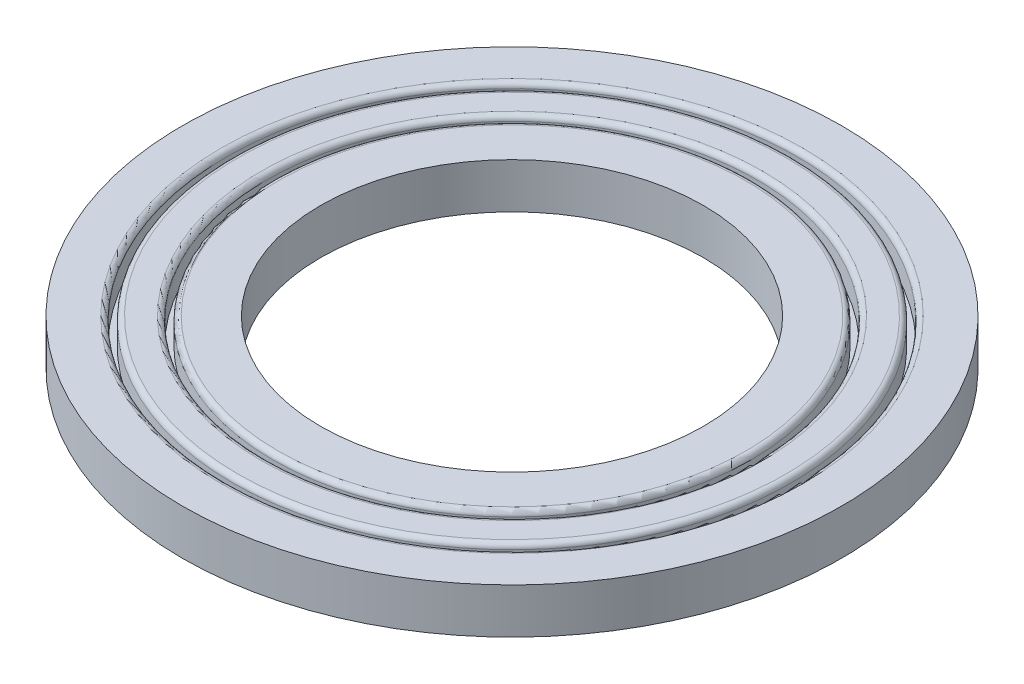
ISO-10303-21;
HEADER;
FILE_DESCRIPTION(('STEP AP214'),'2;1');
FILE_NAME('part.step','',(''),(''),'','','');
FILE_SCHEMA(('AUTOMOTIVE_DESIGN { 1 0 10303 214 1 1 1 1 }'));
ENDSEC;
DATA;
#1=APPLICATION_CONTEXT('core data for automotive mechanical design processes');
#2=APPLICATION_PROTOCOL_DEFINITION('international standard','automotive_design',2000,#1);
#3=PRODUCT_CONTEXT('',#1,'mechanical');
#4=PRODUCT('Part','Part','',(#3));
#5=PRODUCT_RELATED_PRODUCT_CATEGORY('part','',(#4));
#6=PRODUCT_DEFINITION_FORMATION('','',#4);
#7=PRODUCT_DEFINITION_CONTEXT('part definition',#1,'design');
#8=PRODUCT_DEFINITION('design','',#6,#7);
#9=PRODUCT_DEFINITION_SHAPE('','',#8);
#10=(LENGTH_UNIT() NAMED_UNIT(*) SI_UNIT(.MILLI.,.METRE.));
#11=(NAMED_UNIT(*) PLANE_ANGLE_UNIT() SI_UNIT($,.RADIAN.));
#12=(NAMED_UNIT(*) SI_UNIT($,.STERADIAN.) SOLID_ANGLE_UNIT());
#13=UNCERTAINTY_MEASURE_WITH_UNIT(LENGTH_MEASURE(1.E-05),#10,'distance_accuracy_value','');
#14=(GEOMETRIC_REPRESENTATION_CONTEXT(3) GLOBAL_UNCERTAINTY_ASSIGNED_CONTEXT((#13)) GLOBAL_UNIT_ASSIGNED_CONTEXT((#10,
#11,#12)) REPRESENTATION_CONTEXT('',''));
#15=CARTESIAN_POINT('',(0.,0.,0.));
#16=DIRECTION('',(0.,0.,1.));
#17=DIRECTION('',(1.,0.,0.));
#18=AXIS2_PLACEMENT_3D('',#15,#16,#17);
#19=CARTESIAN_POINT('',(0.,3.5,0.));
#20=DIRECTION('',(0.,1.,0.));
#21=DIRECTION('',(0.,0.,1.));
#22=AXIS2_PLACEMENT_3D('',#19,#20,#21);
#23=PLANE('',#22);
#24=CARTESIAN_POINT('',(0.,3.5,0.));
#25=DIRECTION('',(0.,1.,0.));
#26=DIRECTION('',(0.,0.,1.));
#27=AXIS2_PLACEMENT_3D('',#24,#25,#26);
#28=CIRCLE('',#27,19.4);
#29=CARTESIAN_POINT('',(0.,3.5,19.4));
#30=VERTEX_POINT('',#29);
#31=EDGE_CURVE('E65',#30,#30,#28,.F.);
#32=ORIENTED_EDGE('',*,*,#31,.T.);
#33=EDGE_LOOP('',(#32));
#34=FACE_BOUND('',#33,.T.);
#35=CARTESIAN_POINT('',(0.,3.5,0.));
#36=DIRECTION('',(0.,1.,0.));
#37=DIRECTION('',(0.,0.,1.));
#38=AXIS2_PLACEMENT_3D('',#35,#36,#37);
#39=CIRCLE('',#38,21.2);
#40=CARTESIAN_POINT('',(0.,3.5,21.2));
#41=VERTEX_POINT('',#40);
#42=EDGE_CURVE('E70',#41,#41,#39,.T.);
#43=ORIENTED_EDGE('',*,*,#42,.T.);
#44=EDGE_LOOP('',(#43));
#45=FACE_BOUND('',#44,.T.);
#46=ADVANCED_FACE('F41',(#34,#45),#23,.T.);
#47=CARTESIAN_POINT('',(0.,1.5,0.));
#48=DIRECTION('',(0.,1.,0.));
#49=DIRECTION('',(0.,0.,1.));
#50=AXIS2_PLACEMENT_3D('',#47,#48,#49);
#51=CYLINDRICAL_SURFACE('',#50,19.);
#52=CARTESIAN_POINT('',(0.,3.1,0.));
#53=DIRECTION('',(0.,1.,0.));
#54=DIRECTION('',(0.,0.,1.));
#55=AXIS2_PLACEMENT_3D('',#52,#53,#54);
#56=CIRCLE('',#55,19.);
#57=CARTESIAN_POINT('',(0.,3.1,19.));
#58=VERTEX_POINT('',#57);
#59=EDGE_CURVE('E74',#58,#58,#56,.T.);
#60=ORIENTED_EDGE('',*,*,#59,.T.);
#61=EDGE_LOOP('',(#60));
#62=FACE_BOUND('',#61,.T.);
#63=CARTESIAN_POINT('',(0.,1.5,0.));
#64=DIRECTION('',(0.,1.,0.));
#65=DIRECTION('',(0.,0.,1.));
#66=AXIS2_PLACEMENT_3D('',#63,#64,#65);
#67=CIRCLE('',#66,19.);
#68=CARTESIAN_POINT('',(0.,1.5,19.));
#69=VERTEX_POINT('',#68);
#70=EDGE_CURVE('E90',#69,#69,#67,.T.);
#71=ORIENTED_EDGE('',*,*,#70,.F.);
#72=EDGE_LOOP('',(#71));
#73=FACE_BOUND('',#72,.T.);
#74=ADVANCED_FACE('F140',(#62,#73),#51,.F.);
#75=CARTESIAN_POINT('',(0.,1.5,0.));
#76=DIRECTION('',(0.,1.,0.));
#77=DIRECTION('',(0.,0.,1.));
#78=AXIS2_PLACEMENT_3D('',#75,#76,#77);
#79=PLANE('',#78);
#80=CARTESIAN_POINT('',(0.,1.5,0.));
#81=DIRECTION('',(0.,1.,0.));
#82=DIRECTION('',(0.,0.,1.));
#83=AXIS2_PLACEMENT_3D('',#80,#81,#82);
#84=CIRCLE('',#83,18.5);
#85=CARTESIAN_POINT('',(0.,1.5,18.5));
#86=VERTEX_POINT('',#85);
#87=EDGE_CURVE('E96',#86,#86,#84,.T.);
#88=ORIENTED_EDGE('',*,*,#87,.F.);
#89=EDGE_LOOP('',(#88));
#90=FACE_BOUND('',#89,.T.);
#91=ORIENTED_EDGE('',*,*,#70,.T.);
#92=EDGE_LOOP('',(#91));
#93=FACE_BOUND('',#92,.T.);
#94=ADVANCED_FACE('F145',(#90,#93),#79,.T.);
#95=CARTESIAN_POINT('',(0.,1.5,0.));
#96=DIRECTION('',(0.,1.,0.));
#97=DIRECTION('',(0.,0.,1.));
#98=AXIS2_PLACEMENT_3D('',#95,#96,#97);
#99=CYLINDRICAL_SURFACE('',#98,18.5);
#100=CARTESIAN_POINT('',(0.,3.1,0.));
#101=DIRECTION('',(0.,1.,0.));
#102=DIRECTION('',(0.,0.,1.));
#103=AXIS2_PLACEMENT_3D('',#100,#101,#102);
#104=CIRCLE('',#103,18.5);
#105=CARTESIAN_POINT('',(0.,3.1,18.5));
#106=VERTEX_POINT('',#105);
#107=EDGE_CURVE('E77',#106,#106,#104,.F.);
#108=ORIENTED_EDGE('',*,*,#107,.T.);
#109=EDGE_LOOP('',(#108));
#110=FACE_BOUND('',#109,.T.);
#111=ORIENTED_EDGE('',*,*,#87,.T.);
#112=EDGE_LOOP('',(#111));
#113=FACE_BOUND('',#112,.T.);
#114=ADVANCED_FACE('F151',(#110,#113),#99,.T.);
#115=CARTESIAN_POINT('',(0.,3.5,0.));
#116=DIRECTION('',(0.,1.,0.));
#117=DIRECTION('',(0.,0.,1.));
#118=AXIS2_PLACEMENT_3D('',#115,#116,#117);
#119=CIRCLE('',#118,14.8090020246862);
#120=CARTESIAN_POINT('',(0.,3.5,14.8090020246862));
#121=VERTEX_POINT('',#120);
#122=EDGE_CURVE('E108',#121,#121,#119,.T.);
#123=ORIENTED_EDGE('',*,*,#122,.F.);
#124=EDGE_LOOP('',(#123));
#125=FACE_BOUND('',#124,.T.);
#126=CARTESIAN_POINT('',(0.,3.5,0.));
#127=DIRECTION('',(0.,1.,0.));
#128=DIRECTION('',(0.,0.,1.));
#129=AXIS2_PLACEMENT_3D('',#126,#127,#128);
#130=CIRCLE('',#129,18.1);
#131=CARTESIAN_POINT('',(0.,3.5,18.1));
#132=VERTEX_POINT('',#131);
#133=EDGE_CURVE('E81',#132,#132,#130,.T.);
#134=ORIENTED_EDGE('',*,*,#133,.T.);
#135=EDGE_LOOP('',(#134));
#136=FACE_BOUND('',#135,.T.);
#137=ADVANCED_FACE('F136',(#125,#136),#23,.T.);
#138=CARTESIAN_POINT('',(0.,1.5,0.));
#139=DIRECTION('',(0.,1.,0.));
#140=DIRECTION('',(0.,0.,1.));
#141=AXIS2_PLACEMENT_3D('',#138,#139,#140);
#142=CYLINDRICAL_SURFACE('',#141,22.1);
#143=CARTESIAN_POINT('',(0.,3.1,0.));
#144=DIRECTION('',(0.,1.,0.));
#145=DIRECTION('',(0.,0.,1.));
#146=AXIS2_PLACEMENT_3D('',#143,#144,#145);
#147=CIRCLE('',#146,22.1);
#148=CARTESIAN_POINT('',(0.,3.1,22.1));
#149=VERTEX_POINT('',#148);
#150=EDGE_CURVE('E49',#149,#149,#147,.T.);
#151=ORIENTED_EDGE('',*,*,#150,.T.);
#152=EDGE_LOOP('',(#151));
#153=FACE_BOUND('',#152,.T.);
#154=CARTESIAN_POINT('',(0.,1.5,0.));
#155=DIRECTION('',(0.,1.,0.));
#156=DIRECTION('',(0.,0.,1.));
#157=AXIS2_PLACEMENT_3D('',#154,#155,#156);
#158=CIRCLE('',#157,22.1);
#159=CARTESIAN_POINT('',(0.,1.5,22.1));
#160=VERTEX_POINT('',#159);
#161=EDGE_CURVE('E100',#160,#160,#158,.T.);
#162=ORIENTED_EDGE('',*,*,#161,.F.);
#163=EDGE_LOOP('',(#162));
#164=FACE_BOUND('',#163,.T.);
#165=ADVANCED_FACE('F150',(#153,#164),#142,.F.);
#166=CARTESIAN_POINT('',(0.,1.5,0.));
#167=DIRECTION('',(0.,1.,0.));
#168=DIRECTION('',(0.,0.,1.));
#169=AXIS2_PLACEMENT_3D('',#166,#167,#168);
#170=PLANE('',#169);
#171=CARTESIAN_POINT('',(0.,1.5,0.));
#172=DIRECTION('',(0.,1.,0.));
#173=DIRECTION('',(0.,0.,1.));
#174=AXIS2_PLACEMENT_3D('',#171,#172,#173);
#175=CIRCLE('',#174,21.6);
#176=CARTESIAN_POINT('',(0.,1.5,21.6));
#177=VERTEX_POINT('',#176);
#178=EDGE_CURVE('E104',#177,#177,#175,.T.);
#179=ORIENTED_EDGE('',*,*,#178,.F.);
#180=EDGE_LOOP('',(#179));
#181=FACE_BOUND('',#180,.T.);
#182=ORIENTED_EDGE('',*,*,#161,.T.);
#183=EDGE_LOOP('',(#182));
#184=FACE_BOUND('',#183,.T.);
#185=ADVANCED_FACE('F157',(#181,#184),#170,.T.);
#186=CARTESIAN_POINT('',(0.,1.5,0.));
#187=DIRECTION('',(0.,1.,0.));
#188=DIRECTION('',(0.,0.,1.));
#189=AXIS2_PLACEMENT_3D('',#186,#187,#188);
#190=CYLINDRICAL_SURFACE('',#189,21.6);
#191=CARTESIAN_POINT('',(0.,3.1,0.));
#192=DIRECTION('',(0.,1.,0.));
#193=DIRECTION('',(0.,0.,1.));
#194=AXIS2_PLACEMENT_3D('',#191,#192,#193);
#195=CIRCLE('',#194,21.6);
#196=CARTESIAN_POINT('',(0.,3.1,21.6));
#197=VERTEX_POINT('',#196);
#198=EDGE_CURVE('E57',#197,#197,#195,.F.);
#199=ORIENTED_EDGE('',*,*,#198,.T.);
#200=EDGE_LOOP('',(#199));
#201=FACE_BOUND('',#200,.T.);
#202=ORIENTED_EDGE('',*,*,#178,.T.);
#203=EDGE_LOOP('',(#202));
#204=FACE_BOUND('',#203,.T.);
#205=ADVANCED_FACE('F123',(#201,#204),#190,.T.);
#206=CARTESIAN_POINT('',(0.,0.,0.));
#207=DIRECTION('',(0.,1.,0.));
#208=DIRECTION('',(0.,0.,1.));
#209=AXIS2_PLACEMENT_3D('',#206,#207,#208);
#210=PLANE('',#209);
#211=CARTESIAN_POINT('',(0.,0.,0.));
#212=DIRECTION('',(0.,-1.,0.));
#213=DIRECTION('',(0.,0.,-1.));
#214=AXIS2_PLACEMENT_3D('',#211,#212,#213);
#215=CIRCLE('',#214,14.8090020246862);
#216=CARTESIAN_POINT('',(0.,0.,-14.8090020246862));
#217=VERTEX_POINT('',#216);
#218=EDGE_CURVE('E112',#217,#217,#215,.T.);
#219=ORIENTED_EDGE('',*,*,#218,.F.);
#220=EDGE_LOOP('',(#219));
#221=FACE_BOUND('',#220,.T.);
#222=CARTESIAN_POINT('',(0.,0.,0.));
#223=DIRECTION('',(0.,1.,0.));
#224=DIRECTION('',(0.,0.,1.));
#225=AXIS2_PLACEMENT_3D('',#222,#223,#224);
#226=CIRCLE('',#225,25.5);
#227=CARTESIAN_POINT('',(0.,0.,25.5));
#228=VERTEX_POINT('',#227);
#229=EDGE_CURVE('E86',#228,#228,#226,.T.);
#230=ORIENTED_EDGE('',*,*,#229,.F.);
#231=EDGE_LOOP('',(#230));
#232=FACE_BOUND('',#231,.T.);
#233=ADVANCED_FACE('F119',(#221,#232),#210,.F.);
#234=CARTESIAN_POINT('',(0.,3.5,0.));
#235=DIRECTION('',(0.,-1.,0.));
#236=DIRECTION('',(0.,0.,-1.));
#237=AXIS2_PLACEMENT_3D('',#234,#235,#236);
#238=CYLINDRICAL_SURFACE('',#237,25.5);
#239=CARTESIAN_POINT('',(0.,3.5,0.));
#240=DIRECTION('',(0.,1.,0.));
#241=DIRECTION('',(0.,0.,1.));
#242=AXIS2_PLACEMENT_3D('',#239,#240,#241);
#243=CIRCLE('',#242,25.5);
#244=CARTESIAN_POINT('',(0.,3.5,25.5));
#245=VERTEX_POINT('',#244);
#246=EDGE_CURVE('E85',#245,#245,#243,.T.);
#247=ORIENTED_EDGE('',*,*,#246,.F.);
#248=EDGE_LOOP('',(#247));
#249=FACE_BOUND('',#248,.T.);
#250=ORIENTED_EDGE('',*,*,#229,.T.);
#251=EDGE_LOOP('',(#250));
#252=FACE_BOUND('',#251,.T.);
#253=ADVANCED_FACE('F122',(#249,#252),#238,.T.);
#254=CARTESIAN_POINT('',(0.,3.5,0.));
#255=DIRECTION('',(0.,1.,0.));
#256=DIRECTION('',(0.,0.,1.));
#257=AXIS2_PLACEMENT_3D('',#254,#255,#256);
#258=CIRCLE('',#257,22.5);
#259=CARTESIAN_POINT('',(0.,3.5,22.5));
#260=VERTEX_POINT('',#259);
#261=EDGE_CURVE('E10',#260,#260,#258,.F.);
#262=ORIENTED_EDGE('',*,*,#261,.T.);
#263=EDGE_LOOP('',(#262));
#264=FACE_BOUND('',#263,.T.);
#265=ORIENTED_EDGE('',*,*,#246,.T.);
#266=EDGE_LOOP('',(#265));
#267=FACE_BOUND('',#266,.T.);
#268=ADVANCED_FACE('F128',(#264,#267),#23,.T.);
#269=CARTESIAN_POINT('',(0.,3.1,0.));
#270=DIRECTION('',(0.,1.,0.));
#271=DIRECTION('',(0.,0.,1.));
#272=AXIS2_PLACEMENT_3D('',#269,#270,#271);
#273=TOROIDAL_SURFACE('',#272,18.1,0.4);
#274=ORIENTED_EDGE('',*,*,#107,.F.);
#275=EDGE_LOOP('',(#274));
#276=FACE_BOUND('',#275,.T.);
#277=ORIENTED_EDGE('',*,*,#133,.F.);
#278=EDGE_LOOP('',(#277));
#279=FACE_BOUND('',#278,.T.);
#280=ADVANCED_FACE('F134',(#276,#279),#273,.T.);
#281=CARTESIAN_POINT('',(0.,3.1,0.));
#282=DIRECTION('',(0.,1.,0.));
#283=DIRECTION('',(0.,0.,1.));
#284=AXIS2_PLACEMENT_3D('',#281,#282,#283);
#285=TOROIDAL_SURFACE('',#284,19.4,0.4);
#286=ORIENTED_EDGE('',*,*,#31,.F.);
#287=EDGE_LOOP('',(#286));
#288=FACE_BOUND('',#287,.T.);
#289=ORIENTED_EDGE('',*,*,#59,.F.);
#290=EDGE_LOOP('',(#289));
#291=FACE_BOUND('',#290,.T.);
#292=ADVANCED_FACE('F166',(#288,#291),#285,.T.);
#293=CARTESIAN_POINT('',(0.,3.1,0.));
#294=DIRECTION('',(0.,1.,0.));
#295=DIRECTION('',(0.,0.,1.));
#296=AXIS2_PLACEMENT_3D('',#293,#294,#295);
#297=TOROIDAL_SURFACE('',#296,21.2,0.4);
#298=ORIENTED_EDGE('',*,*,#198,.F.);
#299=EDGE_LOOP('',(#298));
#300=FACE_BOUND('',#299,.T.);
#301=ORIENTED_EDGE('',*,*,#42,.F.);
#302=EDGE_LOOP('',(#301));
#303=FACE_BOUND('',#302,.T.);
#304=ADVANCED_FACE('F171',(#300,#303),#297,.T.);
#305=CARTESIAN_POINT('',(0.,3.1,0.));
#306=DIRECTION('',(0.,1.,0.));
#307=DIRECTION('',(0.,0.,1.));
#308=AXIS2_PLACEMENT_3D('',#305,#306,#307);
#309=TOROIDAL_SURFACE('',#308,22.5,0.4);
#310=ORIENTED_EDGE('',*,*,#261,.F.);
#311=EDGE_LOOP('',(#310));
#312=FACE_BOUND('',#311,.T.);
#313=ORIENTED_EDGE('',*,*,#150,.F.);
#314=EDGE_LOOP('',(#313));
#315=FACE_BOUND('',#314,.T.);
#316=ADVANCED_FACE('F43',(#312,#315),#309,.T.);
#317=CARTESIAN_POINT('',(0.,10.,0.));
#318=DIRECTION('',(0.,-1.,0.));
#319=DIRECTION('',(0.,0.,-1.));
#320=AXIS2_PLACEMENT_3D('',#317,#318,#319);
#321=CYLINDRICAL_SURFACE('',#320,14.8090020246862);
#322=ORIENTED_EDGE('',*,*,#122,.T.);
#323=EDGE_LOOP('',(#322));
#324=FACE_BOUND('',#323,.T.);
#325=ORIENTED_EDGE('',*,*,#218,.T.);
#326=EDGE_LOOP('',(#325));
#327=FACE_BOUND('',#326,.T.);
#328=ADVANCED_FACE('F117',(#324,#327),#321,.F.);
#329=CLOSED_SHELL('',(#46,#74,#94,#114,#137,#165,#185,#205,#233,#253,#268,#280,#292,#304,#316,#328));
#330=MANIFOLD_SOLID_BREP('B2',#329);
#331=ADVANCED_BREP_SHAPE_REPRESENTATION('',(#18,#330),#14);
#332=SHAPE_DEFINITION_REPRESENTATION(#9,#331);
ENDSEC;
END-ISO-10303-21;
